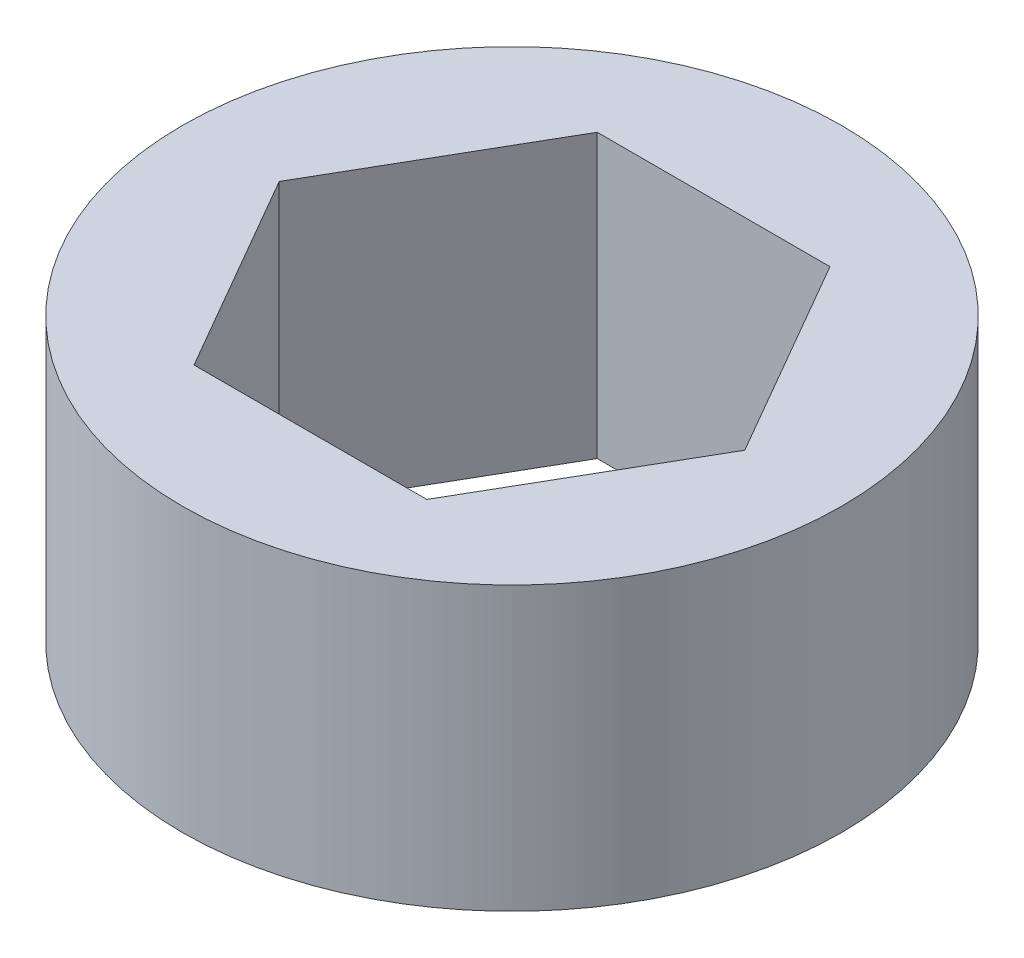
ISO-10303-21;
HEADER;
FILE_DESCRIPTION(('STEP AP214'),'2;1');
FILE_NAME('part.step','',(''),(''),'','','');
FILE_SCHEMA(('AUTOMOTIVE_DESIGN { 1 0 10303 214 1 1 1 1 }'));
ENDSEC;
DATA;
#1=APPLICATION_CONTEXT('core data for automotive mechanical design processes');
#2=APPLICATION_PROTOCOL_DEFINITION('international standard','automotive_design',2000,#1);
#3=PRODUCT_CONTEXT('',#1,'mechanical');
#4=PRODUCT('Part','Part','',(#3));
#5=PRODUCT_RELATED_PRODUCT_CATEGORY('part','',(#4));
#6=PRODUCT_DEFINITION_FORMATION('','',#4);
#7=PRODUCT_DEFINITION_CONTEXT('part definition',#1,'design');
#8=PRODUCT_DEFINITION('design','',#6,#7);
#9=PRODUCT_DEFINITION_SHAPE('','',#8);
#10=(LENGTH_UNIT() NAMED_UNIT(*) SI_UNIT(.MILLI.,.METRE.));
#11=(NAMED_UNIT(*) PLANE_ANGLE_UNIT() SI_UNIT($,.RADIAN.));
#12=(NAMED_UNIT(*) SI_UNIT($,.STERADIAN.) SOLID_ANGLE_UNIT());
#13=UNCERTAINTY_MEASURE_WITH_UNIT(LENGTH_MEASURE(1.E-05),#10,'distance_accuracy_value','');
#14=(GEOMETRIC_REPRESENTATION_CONTEXT(3) GLOBAL_UNCERTAINTY_ASSIGNED_CONTEXT((#13)) GLOBAL_UNIT_ASSIGNED_CONTEXT((#10,
#11,#12)) REPRESENTATION_CONTEXT('',''));
#15=CARTESIAN_POINT('',(0.,0.,0.));
#16=DIRECTION('',(0.,0.,1.));
#17=DIRECTION('',(1.,0.,0.));
#18=AXIS2_PLACEMENT_3D('',#15,#16,#17);
#19=CARTESIAN_POINT('',(0.,9.525,0.));
#20=DIRECTION('',(0.,1.,0.));
#21=DIRECTION('',(0.,0.,1.));
#22=AXIS2_PLACEMENT_3D('',#19,#20,#21);
#23=PLANE('',#22);
#24=CARTESIAN_POINT('',(0.,9.525,0.));
#25=DIRECTION('',(0.,1.,0.));
#26=DIRECTION('',(0.,0.,1.));
#27=AXIS2_PLACEMENT_3D('',#24,#25,#26);
#28=CIRCLE('',#27,11.1125);
#29=CARTESIAN_POINT('',(0.,9.525,11.1125));
#30=VERTEX_POINT('',#29);
#31=EDGE_CURVE('E11',#30,#30,#28,.T.);
#32=ORIENTED_EDGE('',*,*,#31,.T.);
#33=EDGE_LOOP('',(#32));
#34=FACE_BOUND('',#33,.T.);
#35=DIRECTION('',(-0.5,0.,-0.866025403784439));
#36=VECTOR('',#35,1.);
#37=CARTESIAN_POINT('',(7.84561280801783,9.525,0.));
#38=LINE('',#37,#36);
#39=CARTESIAN_POINT('',(7.84561280801783,9.525,0.));
#40=VERTEX_POINT('',#39);
#41=CARTESIAN_POINT('',(3.9228064040089,9.525,-6.79450000000002));
#42=VERTEX_POINT('',#41);
#43=EDGE_CURVE('E94',#40,#42,#38,.T.);
#44=ORIENTED_EDGE('',*,*,#43,.F.);
#45=DIRECTION('',(0.5,0.,-0.866025403784439));
#46=VECTOR('',#45,1.);
#47=CARTESIAN_POINT('',(3.92280640400891,9.525,6.79450000000001));
#48=LINE('',#47,#46);
#49=CARTESIAN_POINT('',(3.92280640400891,9.525,6.79450000000001));
#50=VERTEX_POINT('',#49);
#51=EDGE_CURVE('E86',#50,#40,#48,.T.);
#52=ORIENTED_EDGE('',*,*,#51,.F.);
#53=DIRECTION('',(1.,0.,0.));
#54=VECTOR('',#53,1.);
#55=CARTESIAN_POINT('',(-3.92280640400892,9.525,6.79450000000001));
#56=LINE('',#55,#54);
#57=CARTESIAN_POINT('',(-3.92280640400892,9.525,6.79450000000001));
#58=VERTEX_POINT('',#57);
#59=EDGE_CURVE('E114',#58,#50,#56,.T.);
#60=ORIENTED_EDGE('',*,*,#59,.F.);
#61=DIRECTION('',(0.5,0.,0.866025403784439));
#62=VECTOR('',#61,1.);
#63=CARTESIAN_POINT('',(-7.84561280801784,9.525,0.));
#64=LINE('',#63,#62);
#65=CARTESIAN_POINT('',(-7.84561280801784,9.525,0.));
#66=VERTEX_POINT('',#65);
#67=EDGE_CURVE('E112',#66,#58,#64,.T.);
#68=ORIENTED_EDGE('',*,*,#67,.F.);
#69=DIRECTION('',(-0.5,0.,0.866025403784439));
#70=VECTOR('',#69,1.);
#71=CARTESIAN_POINT('',(-3.92280640400892,9.525,-6.79450000000002));
#72=LINE('',#71,#70);
#73=CARTESIAN_POINT('',(-3.92280640400892,9.525,-6.79450000000002));
#74=VERTEX_POINT('',#73);
#75=EDGE_CURVE('E108',#74,#66,#72,.T.);
#76=ORIENTED_EDGE('',*,*,#75,.F.);
#77=DIRECTION('',(-1.,0.,0.));
#78=VECTOR('',#77,1.);
#79=CARTESIAN_POINT('',(3.9228064040089,9.525,-6.79450000000002));
#80=LINE('',#79,#78);
#81=EDGE_CURVE('E106',#42,#74,#80,.T.);
#82=ORIENTED_EDGE('',*,*,#81,.F.);
#83=EDGE_LOOP('',(#44,#52,#60,#68,#76,#82));
#84=FACE_BOUND('',#83,.T.);
#85=ADVANCED_FACE('F33',(#34,#84),#23,.T.);
#86=CARTESIAN_POINT('',(0.,0.,0.));
#87=DIRECTION('',(0.,1.,0.));
#88=DIRECTION('',(0.,0.,1.));
#89=AXIS2_PLACEMENT_3D('',#86,#87,#88);
#90=PLANE('',#89);
#91=CARTESIAN_POINT('',(0.,0.,0.));
#92=DIRECTION('',(0.,1.,0.));
#93=DIRECTION('',(0.,0.,1.));
#94=AXIS2_PLACEMENT_3D('',#91,#92,#93);
#95=CIRCLE('',#94,11.1125);
#96=CARTESIAN_POINT('',(0.,0.,11.1125));
#97=VERTEX_POINT('',#96);
#98=EDGE_CURVE('E37',#97,#97,#95,.T.);
#99=ORIENTED_EDGE('',*,*,#98,.F.);
#100=EDGE_LOOP('',(#99));
#101=FACE_BOUND('',#100,.T.);
#102=DIRECTION('',(0.5,0.,-0.866025403784439));
#103=VECTOR('',#102,1.);
#104=CARTESIAN_POINT('',(3.92280640400891,0.,6.79450000000001));
#105=LINE('',#104,#103);
#106=CARTESIAN_POINT('',(3.92280640400891,0.,6.79450000000001));
#107=VERTEX_POINT('',#106);
#108=CARTESIAN_POINT('',(7.84561280801783,0.,0.));
#109=VERTEX_POINT('',#108);
#110=EDGE_CURVE('E56',#107,#109,#105,.T.);
#111=ORIENTED_EDGE('',*,*,#110,.T.);
#112=DIRECTION('',(-0.5,0.,-0.866025403784439));
#113=VECTOR('',#112,1.);
#114=CARTESIAN_POINT('',(7.84561280801783,0.,0.));
#115=LINE('',#114,#113);
#116=CARTESIAN_POINT('',(3.9228064040089,0.,-6.79450000000002));
#117=VERTEX_POINT('',#116);
#118=EDGE_CURVE('E101',#109,#117,#115,.T.);
#119=ORIENTED_EDGE('',*,*,#118,.T.);
#120=DIRECTION('',(-1.,0.,0.));
#121=VECTOR('',#120,1.);
#122=CARTESIAN_POINT('',(3.9228064040089,0.,-6.79450000000002));
#123=LINE('',#122,#121);
#124=CARTESIAN_POINT('',(-3.92280640400892,0.,-6.79450000000002));
#125=VERTEX_POINT('',#124);
#126=EDGE_CURVE('E118',#117,#125,#123,.T.);
#127=ORIENTED_EDGE('',*,*,#126,.T.);
#128=DIRECTION('',(-0.5,0.,0.866025403784439));
#129=VECTOR('',#128,1.);
#130=CARTESIAN_POINT('',(-3.92280640400892,0.,-6.79450000000002));
#131=LINE('',#130,#129);
#132=CARTESIAN_POINT('',(-7.84561280801784,0.,0.));
#133=VERTEX_POINT('',#132);
#134=EDGE_CURVE('E121',#125,#133,#131,.T.);
#135=ORIENTED_EDGE('',*,*,#134,.T.);
#136=DIRECTION('',(0.5,0.,0.866025403784439));
#137=VECTOR('',#136,1.);
#138=CARTESIAN_POINT('',(-7.84561280801784,0.,0.));
#139=LINE('',#138,#137);
#140=CARTESIAN_POINT('',(-3.92280640400892,0.,6.79450000000001));
#141=VERTEX_POINT('',#140);
#142=EDGE_CURVE('E124',#133,#141,#139,.T.);
#143=ORIENTED_EDGE('',*,*,#142,.T.);
#144=DIRECTION('',(1.,0.,0.));
#145=VECTOR('',#144,1.);
#146=CARTESIAN_POINT('',(-3.92280640400892,0.,6.79450000000001));
#147=LINE('',#146,#145);
#148=EDGE_CURVE('E95',#141,#107,#147,.T.);
#149=ORIENTED_EDGE('',*,*,#148,.T.);
#150=EDGE_LOOP('',(#111,#119,#127,#135,#143,#149));
#151=FACE_BOUND('',#150,.T.);
#152=ADVANCED_FACE('F141',(#101,#151),#90,.F.);
#153=CARTESIAN_POINT('',(0.,9.525,0.));
#154=DIRECTION('',(0.,-1.,0.));
#155=DIRECTION('',(0.,0.,-1.));
#156=AXIS2_PLACEMENT_3D('',#153,#154,#155);
#157=CYLINDRICAL_SURFACE('',#156,11.1125);
#158=ORIENTED_EDGE('',*,*,#31,.F.);
#159=EDGE_LOOP('',(#158));
#160=FACE_BOUND('',#159,.T.);
#161=ORIENTED_EDGE('',*,*,#98,.T.);
#162=EDGE_LOOP('',(#161));
#163=FACE_BOUND('',#162,.T.);
#164=ADVANCED_FACE('F35',(#160,#163),#157,.T.);
#165=CARTESIAN_POINT('',(3.92280640400891,9.525,6.79450000000001));
#166=DIRECTION('',(-0.866025403784439,0.,-0.5));
#167=DIRECTION('',(-0.5,0.,0.866025403784439));
#168=AXIS2_PLACEMENT_3D('',#165,#166,#167);
#169=PLANE('',#168);
#170=ORIENTED_EDGE('',*,*,#110,.F.);
#171=DIRECTION('',(0.,-1.,0.));
#172=VECTOR('',#171,1.);
#173=CARTESIAN_POINT('',(3.92280640400891,9.525,6.79450000000001));
#174=LINE('',#173,#172);
#175=EDGE_CURVE('E90',#50,#107,#174,.T.);
#176=ORIENTED_EDGE('',*,*,#175,.F.);
#177=ORIENTED_EDGE('',*,*,#51,.T.);
#178=DIRECTION('',(0.,-1.,0.));
#179=VECTOR('',#178,1.);
#180=CARTESIAN_POINT('',(7.84561280801783,9.525,0.));
#181=LINE('',#180,#179);
#182=EDGE_CURVE('E89',#40,#109,#181,.T.);
#183=ORIENTED_EDGE('',*,*,#182,.T.);
#184=EDGE_LOOP('',(#170,#176,#177,#183));
#185=FACE_BOUND('',#184,.T.);
#186=ADVANCED_FACE('F88',(#185),#169,.T.);
#187=CARTESIAN_POINT('',(7.84561280801783,9.525,0.));
#188=DIRECTION('',(-0.866025403784439,0.,0.5));
#189=DIRECTION('',(0.5,0.,0.866025403784438));
#190=AXIS2_PLACEMENT_3D('',#187,#188,#189);
#191=PLANE('',#190);
#192=ORIENTED_EDGE('',*,*,#118,.F.);
#193=ORIENTED_EDGE('',*,*,#182,.F.);
#194=ORIENTED_EDGE('',*,*,#43,.T.);
#195=DIRECTION('',(0.,-1.,0.));
#196=VECTOR('',#195,1.);
#197=CARTESIAN_POINT('',(3.9228064040089,9.525,-6.79450000000002));
#198=LINE('',#197,#196);
#199=EDGE_CURVE('E102',#42,#117,#198,.T.);
#200=ORIENTED_EDGE('',*,*,#199,.T.);
#201=EDGE_LOOP('',(#192,#193,#194,#200));
#202=FACE_BOUND('',#201,.T.);
#203=ADVANCED_FACE('F98',(#202),#191,.T.);
#204=CARTESIAN_POINT('',(3.9228064040089,9.525,-6.79450000000002));
#205=DIRECTION('',(0.,0.,1.));
#206=DIRECTION('',(1.,0.,0.));
#207=AXIS2_PLACEMENT_3D('',#204,#205,#206);
#208=PLANE('',#207);
#209=ORIENTED_EDGE('',*,*,#126,.F.);
#210=ORIENTED_EDGE('',*,*,#199,.F.);
#211=ORIENTED_EDGE('',*,*,#81,.T.);
#212=DIRECTION('',(0.,-1.,0.));
#213=VECTOR('',#212,1.);
#214=CARTESIAN_POINT('',(-3.92280640400892,9.525,-6.79450000000002));
#215=LINE('',#214,#213);
#216=EDGE_CURVE('E133',#74,#125,#215,.T.);
#217=ORIENTED_EDGE('',*,*,#216,.T.);
#218=EDGE_LOOP('',(#209,#210,#211,#217));
#219=FACE_BOUND('',#218,.T.);
#220=ADVANCED_FACE('F137',(#219),#208,.T.);
#221=CARTESIAN_POINT('',(-3.92280640400892,9.525,-6.79450000000002));
#222=DIRECTION('',(0.866025403784439,0.,0.5));
#223=DIRECTION('',(0.5,0.,-0.866025403784439));
#224=AXIS2_PLACEMENT_3D('',#221,#222,#223);
#225=PLANE('',#224);
#226=ORIENTED_EDGE('',*,*,#134,.F.);
#227=ORIENTED_EDGE('',*,*,#216,.F.);
#228=ORIENTED_EDGE('',*,*,#75,.T.);
#229=DIRECTION('',(0.,-1.,0.));
#230=VECTOR('',#229,1.);
#231=CARTESIAN_POINT('',(-7.84561280801784,9.525,0.));
#232=LINE('',#231,#230);
#233=EDGE_CURVE('E131',#66,#133,#232,.T.);
#234=ORIENTED_EDGE('',*,*,#233,.T.);
#235=EDGE_LOOP('',(#226,#227,#228,#234));
#236=FACE_BOUND('',#235,.T.);
#237=ADVANCED_FACE('F149',(#236),#225,.T.);
#238=CARTESIAN_POINT('',(-7.84561280801784,9.525,0.));
#239=DIRECTION('',(0.866025403784439,0.,-0.5));
#240=DIRECTION('',(-0.5,0.,-0.866025403784439));
#241=AXIS2_PLACEMENT_3D('',#238,#239,#240);
#242=PLANE('',#241);
#243=ORIENTED_EDGE('',*,*,#142,.F.);
#244=ORIENTED_EDGE('',*,*,#233,.F.);
#245=ORIENTED_EDGE('',*,*,#67,.T.);
#246=DIRECTION('',(0.,-1.,0.));
#247=VECTOR('',#246,1.);
#248=CARTESIAN_POINT('',(-3.92280640400892,9.525,6.79450000000001));
#249=LINE('',#248,#247);
#250=EDGE_CURVE('E48',#58,#141,#249,.T.);
#251=ORIENTED_EDGE('',*,*,#250,.T.);
#252=EDGE_LOOP('',(#243,#244,#245,#251));
#253=FACE_BOUND('',#252,.T.);
#254=ADVANCED_FACE('F147',(#253),#242,.T.);
#255=CARTESIAN_POINT('',(-3.92280640400892,9.525,6.79450000000001));
#256=DIRECTION('',(0.,0.,-1.));
#257=DIRECTION('',(-1.,0.,0.));
#258=AXIS2_PLACEMENT_3D('',#255,#256,#257);
#259=PLANE('',#258);
#260=ORIENTED_EDGE('',*,*,#148,.F.);
#261=ORIENTED_EDGE('',*,*,#250,.F.);
#262=ORIENTED_EDGE('',*,*,#59,.T.);
#263=ORIENTED_EDGE('',*,*,#175,.T.);
#264=EDGE_LOOP('',(#260,#261,#262,#263));
#265=FACE_BOUND('',#264,.T.);
#266=ADVANCED_FACE('F143',(#265),#259,.T.);
#267=CLOSED_SHELL('',(#85,#152,#164,#186,#203,#220,#237,#254,#266));
#268=MANIFOLD_SOLID_BREP('B2',#267);
#269=ADVANCED_BREP_SHAPE_REPRESENTATION('',(#18,#268),#14);
#270=SHAPE_DEFINITION_REPRESENTATION(#9,#269);
ENDSEC;
END-ISO-10303-21;
